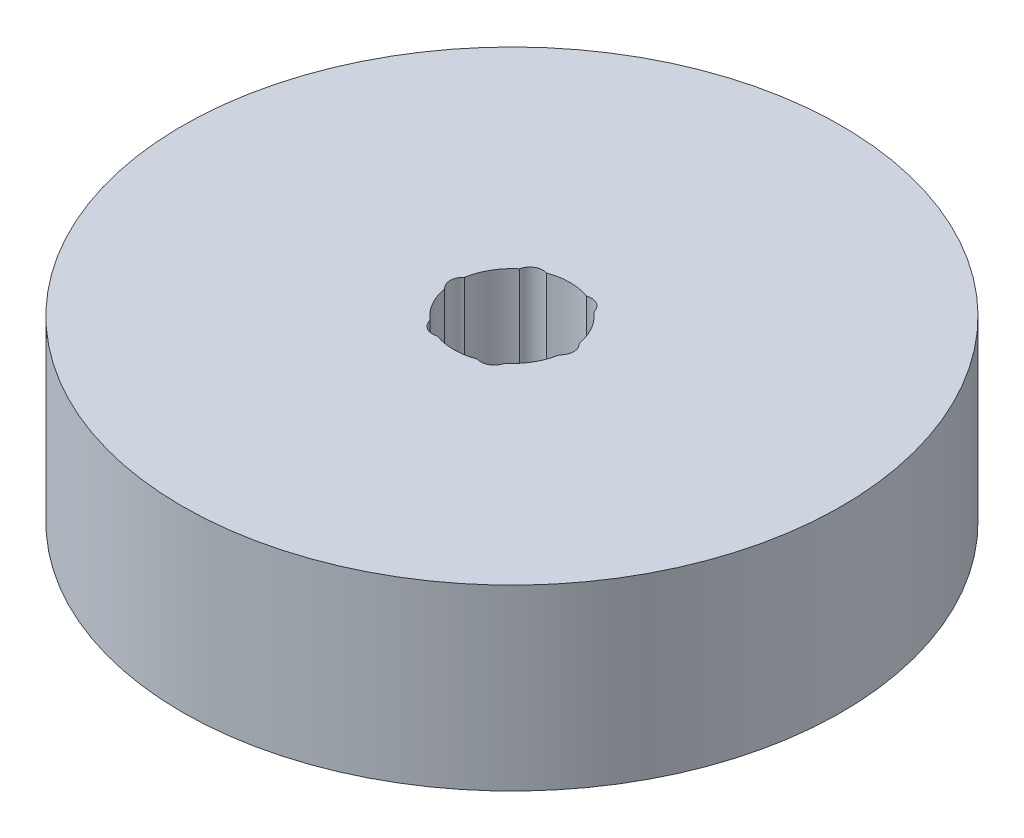
ISO-10303-21;
HEADER;
FILE_DESCRIPTION(('STEP AP214'),'2;1');
FILE_NAME('part.step','',(''),(''),'','','');
FILE_SCHEMA(('AUTOMOTIVE_DESIGN { 1 0 10303 214 1 1 1 1 }'));
ENDSEC;
DATA;
#1=APPLICATION_CONTEXT('core data for automotive mechanical design processes');
#2=APPLICATION_PROTOCOL_DEFINITION('international standard','automotive_design',2000,#1);
#3=PRODUCT_CONTEXT('',#1,'mechanical');
#4=PRODUCT('Part','Part','',(#3));
#5=PRODUCT_RELATED_PRODUCT_CATEGORY('part','',(#4));
#6=PRODUCT_DEFINITION_FORMATION('','',#4);
#7=PRODUCT_DEFINITION_CONTEXT('part definition',#1,'design');
#8=PRODUCT_DEFINITION('design','',#6,#7);
#9=PRODUCT_DEFINITION_SHAPE('','',#8);
#10=(LENGTH_UNIT() NAMED_UNIT(*) SI_UNIT(.MILLI.,.METRE.));
#11=(NAMED_UNIT(*) PLANE_ANGLE_UNIT() SI_UNIT($,.RADIAN.));
#12=(NAMED_UNIT(*) SI_UNIT($,.STERADIAN.) SOLID_ANGLE_UNIT());
#13=UNCERTAINTY_MEASURE_WITH_UNIT(LENGTH_MEASURE(1.E-05),#10,'distance_accuracy_value','');
#14=(GEOMETRIC_REPRESENTATION_CONTEXT(3) GLOBAL_UNCERTAINTY_ASSIGNED_CONTEXT((#13)) GLOBAL_UNIT_ASSIGNED_CONTEXT((#10,
#11,#12)) REPRESENTATION_CONTEXT('',''));
#15=CARTESIAN_POINT('',(0.,0.,0.));
#16=DIRECTION('',(0.,0.,1.));
#17=DIRECTION('',(1.,0.,0.));
#18=AXIS2_PLACEMENT_3D('',#15,#16,#17);
#19=CARTESIAN_POINT('',(0.,23.,0.));
#20=DIRECTION('',(0.,-1.,0.));
#21=DIRECTION('',(0.,0.,-1.));
#22=AXIS2_PLACEMENT_3D('',#19,#20,#21);
#23=CYLINDRICAL_SURFACE('',#22,42.5);
#24=CARTESIAN_POINT('',(0.,23.,0.));
#25=DIRECTION('',(0.,1.,0.));
#26=DIRECTION('',(0.,0.,1.));
#27=AXIS2_PLACEMENT_3D('',#24,#25,#26);
#28=CIRCLE('',#27,42.5);
#29=CARTESIAN_POINT('',(0.,23.,42.5));
#30=VERTEX_POINT('',#29);
#31=EDGE_CURVE('E162',#30,#30,#28,.T.);
#32=ORIENTED_EDGE('',*,*,#31,.F.);
#33=EDGE_LOOP('',(#32));
#34=FACE_BOUND('',#33,.T.);
#35=CARTESIAN_POINT('',(0.,0.,0.));
#36=DIRECTION('',(0.,1.,0.));
#37=DIRECTION('',(0.,0.,1.));
#38=AXIS2_PLACEMENT_3D('',#35,#36,#37);
#39=CIRCLE('',#38,42.5);
#40=CARTESIAN_POINT('',(0.,0.,42.5));
#41=VERTEX_POINT('',#40);
#42=EDGE_CURVE('E157',#41,#41,#39,.T.);
#43=ORIENTED_EDGE('',*,*,#42,.T.);
#44=EDGE_LOOP('',(#43));
#45=FACE_BOUND('',#44,.T.);
#46=ADVANCED_FACE('F39',(#34,#45),#23,.T.);
#47=CARTESIAN_POINT('',(0.,23.,0.));
#48=DIRECTION('',(0.,1.,0.));
#49=DIRECTION('',(0.,0.,1.));
#50=AXIS2_PLACEMENT_3D('',#47,#48,#49);
#51=PLANE('',#50);
#52=CARTESIAN_POINT('',(-3.11829148272216,23.,-5.40103928088393));
#53=DIRECTION('',(0.,1.,0.));
#54=DIRECTION('',(-0.866025403784433,0.,0.50000000000001));
#55=AXIS2_PLACEMENT_3D('',#52,#53,#54);
#56=CIRCLE('',#55,1.72194466156208);
#57=CARTESIAN_POINT('',(-2.58805865707622,23.,-7.03931476690259));
#58=VERTEX_POINT('',#57);
#59=CARTESIAN_POINT('',(-4.8021960848346,23.,-5.76098192696342));
#60=VERTEX_POINT('',#59);
#61=EDGE_CURVE('E218',#58,#60,#56,.T.);
#62=ORIENTED_EDGE('',*,*,#61,.F.);
#63=CARTESIAN_POINT('',(0.,23.,0.));
#64=DIRECTION('',(0.,1.,0.));
#65=DIRECTION('',(0.,0.,1.));
#66=AXIS2_PLACEMENT_3D('',#63,#64,#65);
#67=CIRCLE('',#66,7.5);
#68=CARTESIAN_POINT('',(2.58805865707607,23.,-7.03931476690264));
#69=VERTEX_POINT('',#68);
#70=EDGE_CURVE('E169',#69,#58,#67,.T.);
#71=ORIENTED_EDGE('',*,*,#70,.F.);
#72=CARTESIAN_POINT('',(3.11829148272205,23.,-5.401039280884));
#73=DIRECTION('',(0.,1.,0.));
#74=DIRECTION('',(-0.866025403784443,0.,-0.499999999999992));
#75=AXIS2_PLACEMENT_3D('',#72,#73,#74);
#76=CIRCLE('',#75,1.72194466156208);
#77=CARTESIAN_POINT('',(4.80219608483448,23.,-5.76098192696352));
#78=VERTEX_POINT('',#77);
#79=EDGE_CURVE('E285',#78,#69,#76,.T.);
#80=ORIENTED_EDGE('',*,*,#79,.F.);
#81=CARTESIAN_POINT('',(7.39025474191067,23.,-1.27833283993914));
#82=VERTEX_POINT('',#81);
#83=EDGE_CURVE('E174',#82,#78,#67,.T.);
#84=ORIENTED_EDGE('',*,*,#83,.F.);
#85=CARTESIAN_POINT('',(6.2365829654442,23.,0.));
#86=DIRECTION('',(0.,1.,0.));
#87=DIRECTION('',(0.,0.,-1.));
#88=AXIS2_PLACEMENT_3D('',#85,#86,#87);
#89=CIRCLE('',#88,1.72194466156208);
#90=CARTESIAN_POINT('',(7.39025474191067,23.,1.27833283993914));
#91=VERTEX_POINT('',#90);
#92=EDGE_CURVE('E280',#91,#82,#89,.T.);
#93=ORIENTED_EDGE('',*,*,#92,.F.);
#94=CARTESIAN_POINT('',(4.80219608483456,23.,5.76098192696346));
#95=VERTEX_POINT('',#94);
#96=EDGE_CURVE('E164',#95,#91,#67,.T.);
#97=ORIENTED_EDGE('',*,*,#96,.F.);
#98=CARTESIAN_POINT('',(3.11829148272213,23.,5.40103928088396));
#99=DIRECTION('',(0.,1.,0.));
#100=DIRECTION('',(0.866025403784436,0.,-0.500000000000004));
#101=AXIS2_PLACEMENT_3D('',#98,#99,#100);
#102=CIRCLE('',#101,1.72194466156208);
#103=CARTESIAN_POINT('',(2.58805865707617,23.,7.03931476690261));
#104=VERTEX_POINT('',#103);
#105=EDGE_CURVE('E269',#104,#95,#102,.T.);
#106=ORIENTED_EDGE('',*,*,#105,.F.);
#107=CARTESIAN_POINT('',(-2.58805865707612,23.,7.03931476690263));
#108=VERTEX_POINT('',#107);
#109=EDGE_CURVE('E149',#108,#104,#67,.T.);
#110=ORIENTED_EDGE('',*,*,#109,.F.);
#111=CARTESIAN_POINT('',(-3.11829148272209,23.,5.40103928088398));
#112=DIRECTION('',(0.,1.,0.));
#113=DIRECTION('',(0.86602540378444,0.,0.499999999999998));
#114=AXIS2_PLACEMENT_3D('',#111,#112,#113);
#115=CIRCLE('',#114,1.72194466156208);
#116=CARTESIAN_POINT('',(-4.80219608483452,23.,5.76098192696349));
#117=VERTEX_POINT('',#116);
#118=EDGE_CURVE('E128',#117,#108,#115,.T.);
#119=ORIENTED_EDGE('',*,*,#118,.F.);
#120=CARTESIAN_POINT('',(-7.39025474191067,23.,1.27833283993914));
#121=VERTEX_POINT('',#120);
#122=EDGE_CURVE('E148',#121,#117,#67,.T.);
#123=ORIENTED_EDGE('',*,*,#122,.F.);
#124=CARTESIAN_POINT('',(-6.2365829654442,23.,0.));
#125=DIRECTION('',(0.,1.,0.));
#126=DIRECTION('',(0.,0.,1.));
#127=AXIS2_PLACEMENT_3D('',#124,#125,#126);
#128=CIRCLE('',#127,1.72194466156208);
#129=CARTESIAN_POINT('',(-7.39025474191067,23.,-1.27833283993914));
#130=VERTEX_POINT('',#129);
#131=EDGE_CURVE('E179',#130,#121,#128,.T.);
#132=ORIENTED_EDGE('',*,*,#131,.F.);
#133=EDGE_CURVE('E161',#60,#130,#67,.T.);
#134=ORIENTED_EDGE('',*,*,#133,.F.);
#135=EDGE_LOOP('',(#62,#71,#80,#84,#93,#97,#106,#110,#119,#123,#132,#134));
#136=FACE_BOUND('',#135,.T.);
#137=ORIENTED_EDGE('',*,*,#31,.T.);
#138=EDGE_LOOP('',(#137));
#139=FACE_BOUND('',#138,.T.);
#140=ADVANCED_FACE('F141',(#136,#139),#51,.T.);
#141=CARTESIAN_POINT('',(0.,0.,0.));
#142=DIRECTION('',(0.,1.,0.));
#143=DIRECTION('',(0.,0.,1.));
#144=AXIS2_PLACEMENT_3D('',#141,#142,#143);
#145=PLANE('',#144);
#146=CARTESIAN_POINT('',(0.,0.,0.));
#147=DIRECTION('',(0.,1.,0.));
#148=DIRECTION('',(0.,0.,1.));
#149=AXIS2_PLACEMENT_3D('',#146,#147,#148);
#150=CIRCLE('',#149,7.5);
#151=CARTESIAN_POINT('',(0.,0.,7.5));
#152=VERTEX_POINT('',#151);
#153=EDGE_CURVE('E166',#152,#152,#150,.T.);
#154=ORIENTED_EDGE('',*,*,#153,.T.);
#155=EDGE_LOOP('',(#154));
#156=FACE_BOUND('',#155,.T.);
#157=ORIENTED_EDGE('',*,*,#42,.F.);
#158=EDGE_LOOP('',(#157));
#159=FACE_BOUND('',#158,.T.);
#160=ADVANCED_FACE('F234',(#156,#159),#145,.F.);
#161=CARTESIAN_POINT('',(0.,23.,0.));
#162=DIRECTION('',(0.,-1.,0.));
#163=DIRECTION('',(0.,0.,-1.));
#164=AXIS2_PLACEMENT_3D('',#161,#162,#163);
#165=CYLINDRICAL_SURFACE('',#164,7.5);
#166=DIRECTION('',(0.,1.,0.));
#167=VECTOR('',#166,1.);
#168=CARTESIAN_POINT('',(-2.58805865707621,12.4656540048214,-7.03931476690259));
#169=LINE('',#168,#167);
#170=CARTESIAN_POINT('',(-2.58805865707622,1.93130800964277,-7.03931476690259));
#171=VERTEX_POINT('',#170);
#172=EDGE_CURVE('E11',#171,#58,#169,.T.);
#173=ORIENTED_EDGE('',*,*,#172,.F.);
#174=CARTESIAN_POINT('',(0.,1.93130800964277,0.));
#175=DIRECTION('',(0.,1.,0.));
#176=DIRECTION('',(0.,0.,1.));
#177=AXIS2_PLACEMENT_3D('',#174,#175,#176);
#178=CIRCLE('',#177,7.5);
#179=CARTESIAN_POINT('',(-4.8021960848346,1.93130800964277,-5.76098192696342));
#180=VERTEX_POINT('',#179);
#181=EDGE_CURVE('E214',#171,#180,#178,.T.);
#182=ORIENTED_EDGE('',*,*,#181,.T.);
#183=DIRECTION('',(0.,1.,0.));
#184=VECTOR('',#183,1.);
#185=CARTESIAN_POINT('',(-4.8021960848346,12.4656540048214,-5.76098192696342));
#186=LINE('',#185,#184);
#187=EDGE_CURVE('E46',#60,#180,#186,.F.);
#188=ORIENTED_EDGE('',*,*,#187,.F.);
#189=ORIENTED_EDGE('',*,*,#133,.T.);
#190=DIRECTION('',(0.,1.,0.));
#191=VECTOR('',#190,1.);
#192=CARTESIAN_POINT('',(-7.39025474191067,12.4656540048214,-1.27833283993914));
#193=LINE('',#192,#191);
#194=CARTESIAN_POINT('',(-7.39025474191067,1.93130800964277,-1.27833283993914));
#195=VERTEX_POINT('',#194);
#196=EDGE_CURVE('E187',#195,#130,#193,.T.);
#197=ORIENTED_EDGE('',*,*,#196,.F.);
#198=CARTESIAN_POINT('',(0.,1.93130800964277,0.));
#199=DIRECTION('',(0.,1.,0.));
#200=DIRECTION('',(0.,0.,1.));
#201=AXIS2_PLACEMENT_3D('',#198,#199,#200);
#202=CIRCLE('',#201,7.5);
#203=CARTESIAN_POINT('',(-7.39025474191067,1.93130800964277,1.27833283993914));
#204=VERTEX_POINT('',#203);
#205=EDGE_CURVE('E184',#195,#204,#202,.T.);
#206=ORIENTED_EDGE('',*,*,#205,.T.);
#207=DIRECTION('',(0.,1.,0.));
#208=VECTOR('',#207,1.);
#209=CARTESIAN_POINT('',(-7.39025474191067,12.4656540048214,1.27833283993914));
#210=LINE('',#209,#208);
#211=EDGE_CURVE('E158',#121,#204,#210,.F.);
#212=ORIENTED_EDGE('',*,*,#211,.F.);
#213=ORIENTED_EDGE('',*,*,#122,.T.);
#214=DIRECTION('',(0.,1.,0.));
#215=VECTOR('',#214,1.);
#216=CARTESIAN_POINT('',(-4.80219608483452,12.4656540048214,5.76098192696349));
#217=LINE('',#216,#215);
#218=CARTESIAN_POINT('',(-4.80219608483452,1.93130800964277,5.76098192696349));
#219=VERTEX_POINT('',#218);
#220=EDGE_CURVE('E127',#219,#117,#217,.T.);
#221=ORIENTED_EDGE('',*,*,#220,.F.);
#222=CARTESIAN_POINT('',(0.,1.93130800964277,0.));
#223=DIRECTION('',(0.,1.,0.));
#224=DIRECTION('',(0.,0.,1.));
#225=AXIS2_PLACEMENT_3D('',#222,#223,#224);
#226=CIRCLE('',#225,7.5);
#227=CARTESIAN_POINT('',(-2.58805865707612,1.93130800964277,7.03931476690263));
#228=VERTEX_POINT('',#227);
#229=EDGE_CURVE('E189',#219,#228,#226,.T.);
#230=ORIENTED_EDGE('',*,*,#229,.T.);
#231=DIRECTION('',(0.,1.,0.));
#232=VECTOR('',#231,1.);
#233=CARTESIAN_POINT('',(-2.58805865707611,12.4656540048214,7.03931476690262));
#234=LINE('',#233,#232);
#235=EDGE_CURVE('E140',#108,#228,#234,.F.);
#236=ORIENTED_EDGE('',*,*,#235,.F.);
#237=ORIENTED_EDGE('',*,*,#109,.T.);
#238=DIRECTION('',(0.,1.,0.));
#239=VECTOR('',#238,1.);
#240=CARTESIAN_POINT('',(2.58805865707616,12.4656540048214,7.03931476690261));
#241=LINE('',#240,#239);
#242=CARTESIAN_POINT('',(2.58805865707617,1.93130800964277,7.03931476690261));
#243=VERTEX_POINT('',#242);
#244=EDGE_CURVE('E196',#243,#104,#241,.T.);
#245=ORIENTED_EDGE('',*,*,#244,.F.);
#246=CARTESIAN_POINT('',(0.,1.93130800964277,0.));
#247=DIRECTION('',(0.,1.,0.));
#248=DIRECTION('',(0.,0.,1.));
#249=AXIS2_PLACEMENT_3D('',#246,#247,#248);
#250=CIRCLE('',#249,7.5);
#251=CARTESIAN_POINT('',(4.80219608483456,1.93130800964277,5.76098192696346));
#252=VERTEX_POINT('',#251);
#253=EDGE_CURVE('E136',#243,#252,#250,.T.);
#254=ORIENTED_EDGE('',*,*,#253,.T.);
#255=DIRECTION('',(0.,1.,0.));
#256=VECTOR('',#255,1.);
#257=CARTESIAN_POINT('',(4.80219608483456,12.4656540048214,5.76098192696346));
#258=LINE('',#257,#256);
#259=EDGE_CURVE('E194',#95,#252,#258,.F.);
#260=ORIENTED_EDGE('',*,*,#259,.F.);
#261=ORIENTED_EDGE('',*,*,#96,.T.);
#262=DIRECTION('',(0.,1.,0.));
#263=VECTOR('',#262,1.);
#264=CARTESIAN_POINT('',(7.39025474191067,12.4656540048214,1.27833283993914));
#265=LINE('',#264,#263);
#266=CARTESIAN_POINT('',(7.39025474191067,1.93130800964277,1.27833283993914));
#267=VERTEX_POINT('',#266);
#268=EDGE_CURVE('E206',#267,#91,#265,.T.);
#269=ORIENTED_EDGE('',*,*,#268,.F.);
#270=CARTESIAN_POINT('',(0.,1.93130800964277,0.));
#271=DIRECTION('',(0.,1.,0.));
#272=DIRECTION('',(0.,0.,1.));
#273=AXIS2_PLACEMENT_3D('',#270,#271,#272);
#274=CIRCLE('',#273,7.5);
#275=CARTESIAN_POINT('',(7.39025474191067,1.93130800964277,-1.27833283993914));
#276=VERTEX_POINT('',#275);
#277=EDGE_CURVE('E199',#267,#276,#274,.T.);
#278=ORIENTED_EDGE('',*,*,#277,.T.);
#279=DIRECTION('',(0.,1.,0.));
#280=VECTOR('',#279,1.);
#281=CARTESIAN_POINT('',(7.39025474191067,12.4656540048214,-1.27833283993914));
#282=LINE('',#281,#280);
#283=EDGE_CURVE('E201',#82,#276,#282,.F.);
#284=ORIENTED_EDGE('',*,*,#283,.F.);
#285=ORIENTED_EDGE('',*,*,#83,.T.);
#286=DIRECTION('',(0.,1.,0.));
#287=VECTOR('',#286,1.);
#288=CARTESIAN_POINT('',(4.80219608483448,12.4656540048214,-5.76098192696352));
#289=LINE('',#288,#287);
#290=CARTESIAN_POINT('',(4.80219608483448,1.93130800964277,-5.76098192696352));
#291=VERTEX_POINT('',#290);
#292=EDGE_CURVE('E213',#291,#78,#289,.T.);
#293=ORIENTED_EDGE('',*,*,#292,.F.);
#294=CARTESIAN_POINT('',(0.,1.93130800964277,0.));
#295=DIRECTION('',(0.,1.,0.));
#296=DIRECTION('',(0.,0.,1.));
#297=AXIS2_PLACEMENT_3D('',#294,#295,#296);
#298=CIRCLE('',#297,7.5);
#299=CARTESIAN_POINT('',(2.58805865707607,1.93130800964277,-7.03931476690264));
#300=VERTEX_POINT('',#299);
#301=EDGE_CURVE('E208',#291,#300,#298,.T.);
#302=ORIENTED_EDGE('',*,*,#301,.T.);
#303=DIRECTION('',(0.,1.,0.));
#304=VECTOR('',#303,1.);
#305=CARTESIAN_POINT('',(2.58805865707607,12.4656540048214,-7.03931476690264));
#306=LINE('',#305,#304);
#307=EDGE_CURVE('E211',#69,#300,#306,.F.);
#308=ORIENTED_EDGE('',*,*,#307,.F.);
#309=ORIENTED_EDGE('',*,*,#70,.T.);
#310=EDGE_LOOP('',(#173,#182,#188,#189,#197,#206,#212,#213,#221,#230,#236,#237,#245,#254,#260,
#261,#269,#278,#284,#285,#293,#302,#308,#309));
#311=FACE_BOUND('',#310,.T.);
#312=ORIENTED_EDGE('',*,*,#153,.F.);
#313=EDGE_LOOP('',(#312));
#314=FACE_BOUND('',#313,.T.);
#315=ADVANCED_FACE('F152',(#311,#314),#165,.F.);
#316=CARTESIAN_POINT('',(-6.2365829654442,1.93130800964277,0.));
#317=DIRECTION('',(0.,1.,0.));
#318=DIRECTION('',(0.,0.,1.));
#319=AXIS2_PLACEMENT_3D('',#316,#317,#318);
#320=CYLINDRICAL_SURFACE('',#319,1.72194466156208);
#321=ORIENTED_EDGE('',*,*,#196,.T.);
#322=ORIENTED_EDGE('',*,*,#131,.T.);
#323=ORIENTED_EDGE('',*,*,#211,.T.);
#324=CARTESIAN_POINT('',(-6.2365829654442,1.93130800964277,0.));
#325=DIRECTION('',(0.,1.,0.));
#326=DIRECTION('',(0.,0.,1.));
#327=AXIS2_PLACEMENT_3D('',#324,#325,#326);
#328=CIRCLE('',#327,1.72194466156208);
#329=EDGE_CURVE('E180',#195,#204,#328,.T.);
#330=ORIENTED_EDGE('',*,*,#329,.F.);
#331=EDGE_LOOP('',(#321,#322,#323,#330));
#332=FACE_BOUND('',#331,.T.);
#333=ADVANCED_FACE('F244',(#332),#320,.F.);
#334=CARTESIAN_POINT('',(-6.2365829654442,1.93130800964277,0.));
#335=DIRECTION('',(0.,1.,0.));
#336=DIRECTION('',(0.,0.,1.));
#337=AXIS2_PLACEMENT_3D('',#334,#335,#336);
#338=PLANE('',#337);
#339=ORIENTED_EDGE('',*,*,#329,.T.);
#340=ORIENTED_EDGE('',*,*,#205,.F.);
#341=EDGE_LOOP('',(#339,#340));
#342=FACE_BOUND('',#341,.T.);
#343=ADVANCED_FACE('F248',(#342),#338,.T.);
#344=CARTESIAN_POINT('',(-3.11829148272209,1.93130800964277,5.40103928088398));
#345=DIRECTION('',(0.,1.,0.));
#346=DIRECTION('',(0.,0.,1.));
#347=AXIS2_PLACEMENT_3D('',#344,#345,#346);
#348=CYLINDRICAL_SURFACE('',#347,1.72194466156208);
#349=ORIENTED_EDGE('',*,*,#220,.T.);
#350=ORIENTED_EDGE('',*,*,#118,.T.);
#351=ORIENTED_EDGE('',*,*,#235,.T.);
#352=CARTESIAN_POINT('',(-3.11829148272209,1.93130800964277,5.40103928088398));
#353=DIRECTION('',(0.,1.,0.));
#354=DIRECTION('',(0.86602540378444,0.,0.499999999999998));
#355=AXIS2_PLACEMENT_3D('',#352,#353,#354);
#356=CIRCLE('',#355,1.72194466156208);
#357=EDGE_CURVE('E135',#219,#228,#356,.T.);
#358=ORIENTED_EDGE('',*,*,#357,.F.);
#359=EDGE_LOOP('',(#349,#350,#351,#358));
#360=FACE_BOUND('',#359,.T.);
#361=ADVANCED_FACE('F126',(#360),#348,.F.);
#362=CARTESIAN_POINT('',(-3.11829148272209,1.93130800964277,5.40103928088398));
#363=DIRECTION('',(0.,1.,0.));
#364=DIRECTION('',(0.86602540378444,0.,0.499999999999998));
#365=AXIS2_PLACEMENT_3D('',#362,#363,#364);
#366=PLANE('',#365);
#367=ORIENTED_EDGE('',*,*,#357,.T.);
#368=ORIENTED_EDGE('',*,*,#229,.F.);
#369=EDGE_LOOP('',(#367,#368));
#370=FACE_BOUND('',#369,.T.);
#371=ADVANCED_FACE('F258',(#370),#366,.T.);
#372=CARTESIAN_POINT('',(3.11829148272213,1.93130800964277,5.40103928088396));
#373=DIRECTION('',(0.,1.,0.));
#374=DIRECTION('',(0.,0.,1.));
#375=AXIS2_PLACEMENT_3D('',#372,#373,#374);
#376=CYLINDRICAL_SURFACE('',#375,1.72194466156208);
#377=ORIENTED_EDGE('',*,*,#244,.T.);
#378=ORIENTED_EDGE('',*,*,#105,.T.);
#379=ORIENTED_EDGE('',*,*,#259,.T.);
#380=CARTESIAN_POINT('',(3.11829148272213,1.93130800964277,5.40103928088396));
#381=DIRECTION('',(0.,1.,0.));
#382=DIRECTION('',(0.866025403784436,0.,-0.500000000000004));
#383=AXIS2_PLACEMENT_3D('',#380,#381,#382);
#384=CIRCLE('',#383,1.72194466156208);
#385=EDGE_CURVE('E147',#243,#252,#384,.T.);
#386=ORIENTED_EDGE('',*,*,#385,.F.);
#387=EDGE_LOOP('',(#377,#378,#379,#386));
#388=FACE_BOUND('',#387,.T.);
#389=ADVANCED_FACE('F256',(#388),#376,.F.);
#390=CARTESIAN_POINT('',(3.11829148272213,1.93130800964277,5.40103928088396));
#391=DIRECTION('',(0.,1.,0.));
#392=DIRECTION('',(0.866025403784436,0.,-0.500000000000004));
#393=AXIS2_PLACEMENT_3D('',#390,#391,#392);
#394=PLANE('',#393);
#395=ORIENTED_EDGE('',*,*,#385,.T.);
#396=ORIENTED_EDGE('',*,*,#253,.F.);
#397=EDGE_LOOP('',(#395,#396));
#398=FACE_BOUND('',#397,.T.);
#399=ADVANCED_FACE('F263',(#398),#394,.T.);
#400=CARTESIAN_POINT('',(6.2365829654442,1.93130800964277,0.));
#401=DIRECTION('',(0.,1.,0.));
#402=DIRECTION('',(0.,0.,1.));
#403=AXIS2_PLACEMENT_3D('',#400,#401,#402);
#404=CYLINDRICAL_SURFACE('',#403,1.72194466156208);
#405=ORIENTED_EDGE('',*,*,#268,.T.);
#406=ORIENTED_EDGE('',*,*,#92,.T.);
#407=ORIENTED_EDGE('',*,*,#283,.T.);
#408=CARTESIAN_POINT('',(6.2365829654442,1.93130800964277,0.));
#409=DIRECTION('',(0.,1.,0.));
#410=DIRECTION('',(0.,0.,-1.));
#411=AXIS2_PLACEMENT_3D('',#408,#409,#410);
#412=CIRCLE('',#411,1.72194466156208);
#413=EDGE_CURVE('E273',#267,#276,#412,.T.);
#414=ORIENTED_EDGE('',*,*,#413,.F.);
#415=EDGE_LOOP('',(#405,#406,#407,#414));
#416=FACE_BOUND('',#415,.T.);
#417=ADVANCED_FACE('F297',(#416),#404,.F.);
#418=CARTESIAN_POINT('',(6.2365829654442,1.93130800964277,0.));
#419=DIRECTION('',(0.,1.,0.));
#420=DIRECTION('',(0.,0.,-1.));
#421=AXIS2_PLACEMENT_3D('',#418,#419,#420);
#422=PLANE('',#421);
#423=ORIENTED_EDGE('',*,*,#413,.T.);
#424=ORIENTED_EDGE('',*,*,#277,.F.);
#425=EDGE_LOOP('',(#423,#424));
#426=FACE_BOUND('',#425,.T.);
#427=ADVANCED_FACE('F299',(#426),#422,.T.);
#428=CARTESIAN_POINT('',(3.11829148272205,1.93130800964277,-5.401039280884));
#429=DIRECTION('',(0.,1.,0.));
#430=DIRECTION('',(0.,0.,1.));
#431=AXIS2_PLACEMENT_3D('',#428,#429,#430);
#432=CYLINDRICAL_SURFACE('',#431,1.72194466156208);
#433=ORIENTED_EDGE('',*,*,#292,.T.);
#434=ORIENTED_EDGE('',*,*,#79,.T.);
#435=ORIENTED_EDGE('',*,*,#307,.T.);
#436=CARTESIAN_POINT('',(3.11829148272205,1.93130800964277,-5.401039280884));
#437=DIRECTION('',(0.,1.,0.));
#438=DIRECTION('',(-0.866025403784443,0.,-0.499999999999992));
#439=AXIS2_PLACEMENT_3D('',#436,#437,#438);
#440=CIRCLE('',#439,1.72194466156208);
#441=EDGE_CURVE('E56',#291,#300,#440,.T.);
#442=ORIENTED_EDGE('',*,*,#441,.F.);
#443=EDGE_LOOP('',(#433,#434,#435,#442));
#444=FACE_BOUND('',#443,.T.);
#445=ADVANCED_FACE('F292',(#444),#432,.F.);
#446=CARTESIAN_POINT('',(3.11829148272205,1.93130800964277,-5.401039280884));
#447=DIRECTION('',(0.,1.,0.));
#448=DIRECTION('',(-0.866025403784443,0.,-0.499999999999992));
#449=AXIS2_PLACEMENT_3D('',#446,#447,#448);
#450=PLANE('',#449);
#451=ORIENTED_EDGE('',*,*,#441,.T.);
#452=ORIENTED_EDGE('',*,*,#301,.F.);
#453=EDGE_LOOP('',(#451,#452));
#454=FACE_BOUND('',#453,.T.);
#455=ADVANCED_FACE('F226',(#454),#450,.T.);
#456=CARTESIAN_POINT('',(-3.11829148272216,1.93130800964277,-5.40103928088393));
#457=DIRECTION('',(0.,1.,0.));
#458=DIRECTION('',(0.,0.,1.));
#459=AXIS2_PLACEMENT_3D('',#456,#457,#458);
#460=CYLINDRICAL_SURFACE('',#459,1.72194466156208);
#461=ORIENTED_EDGE('',*,*,#172,.T.);
#462=ORIENTED_EDGE('',*,*,#61,.T.);
#463=ORIENTED_EDGE('',*,*,#187,.T.);
#464=CARTESIAN_POINT('',(-3.11829148272216,1.93130800964277,-5.40103928088393));
#465=DIRECTION('',(0.,1.,0.));
#466=DIRECTION('',(-0.866025403784433,0.,0.50000000000001));
#467=AXIS2_PLACEMENT_3D('',#464,#465,#466);
#468=CIRCLE('',#467,1.72194466156208);
#469=EDGE_CURVE('E55',#171,#180,#468,.T.);
#470=ORIENTED_EDGE('',*,*,#469,.F.);
#471=EDGE_LOOP('',(#461,#462,#463,#470));
#472=FACE_BOUND('',#471,.T.);
#473=ADVANCED_FACE('F217',(#472),#460,.F.);
#474=CARTESIAN_POINT('',(-3.11829148272216,1.93130800964277,-5.40103928088393));
#475=DIRECTION('',(0.,1.,0.));
#476=DIRECTION('',(-0.866025403784433,0.,0.50000000000001));
#477=AXIS2_PLACEMENT_3D('',#474,#475,#476);
#478=PLANE('',#477);
#479=ORIENTED_EDGE('',*,*,#469,.T.);
#480=ORIENTED_EDGE('',*,*,#181,.F.);
#481=EDGE_LOOP('',(#479,#480));
#482=FACE_BOUND('',#481,.T.);
#483=ADVANCED_FACE('F219',(#482),#478,.T.);
#484=CLOSED_SHELL('',(#46,#140,#160,#315,#333,#343,#361,#371,#389,#399,#417,#427,#445,#455,#473,#483));
#485=MANIFOLD_SOLID_BREP('B2',#484);
#486=ADVANCED_BREP_SHAPE_REPRESENTATION('',(#18,#485),#14);
#487=SHAPE_DEFINITION_REPRESENTATION(#9,#486);
ENDSEC;
END-ISO-10303-21;
